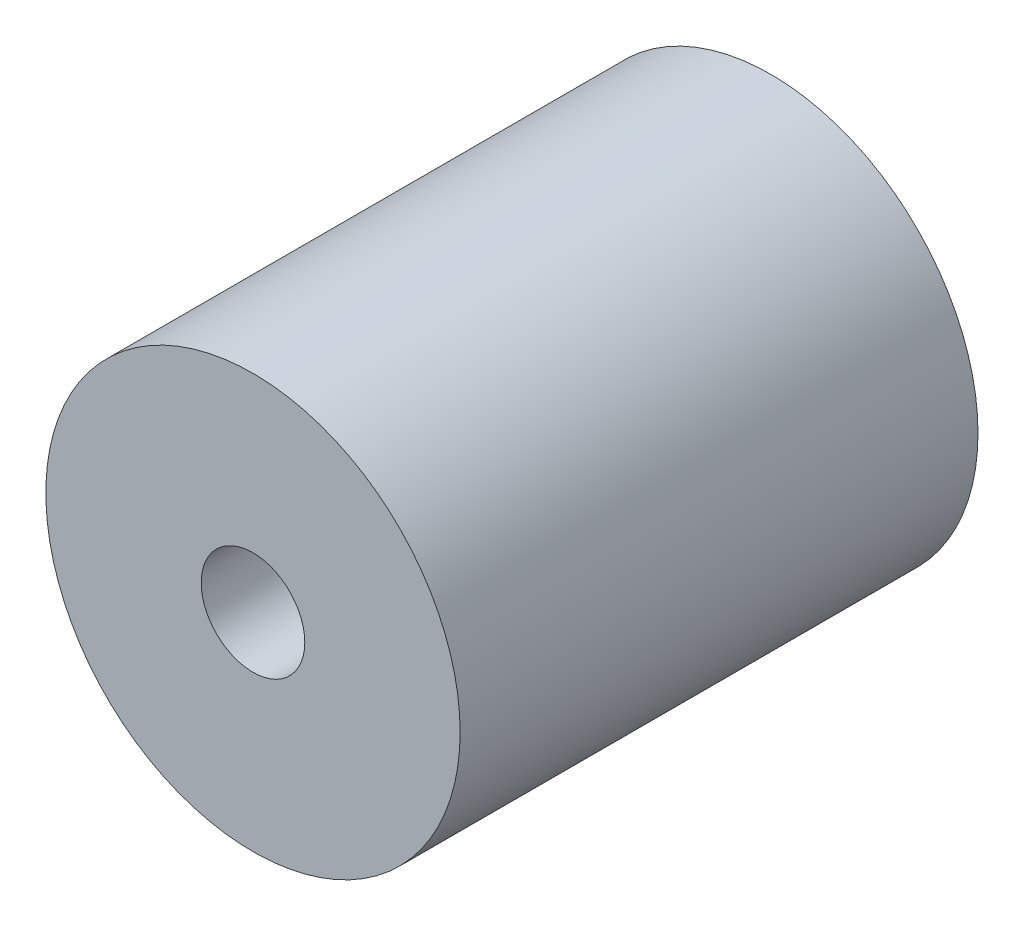
ISO-10303-21;
HEADER;
FILE_DESCRIPTION(('STEP AP214'),'2;1');
FILE_NAME('part.step','',(''),(''),'','','');
FILE_SCHEMA(('AUTOMOTIVE_DESIGN { 1 0 10303 214 1 1 1 1 }'));
ENDSEC;
DATA;
#1=APPLICATION_CONTEXT('core data for automotive mechanical design processes');
#2=APPLICATION_PROTOCOL_DEFINITION('international standard','automotive_design',2000,#1);
#3=PRODUCT_CONTEXT('',#1,'mechanical');
#4=PRODUCT('Part','Part','',(#3));
#5=PRODUCT_RELATED_PRODUCT_CATEGORY('part','',(#4));
#6=PRODUCT_DEFINITION_FORMATION('','',#4);
#7=PRODUCT_DEFINITION_CONTEXT('part definition',#1,'design');
#8=PRODUCT_DEFINITION('design','',#6,#7);
#9=PRODUCT_DEFINITION_SHAPE('','',#8);
#10=(LENGTH_UNIT() NAMED_UNIT(*) SI_UNIT(.MILLI.,.METRE.));
#11=(NAMED_UNIT(*) PLANE_ANGLE_UNIT() SI_UNIT($,.RADIAN.));
#12=(NAMED_UNIT(*) SI_UNIT($,.STERADIAN.) SOLID_ANGLE_UNIT());
#13=UNCERTAINTY_MEASURE_WITH_UNIT(LENGTH_MEASURE(1.E-05),#10,'distance_accuracy_value','');
#14=(GEOMETRIC_REPRESENTATION_CONTEXT(3) GLOBAL_UNCERTAINTY_ASSIGNED_CONTEXT((#13)) GLOBAL_UNIT_ASSIGNED_CONTEXT((#10,
#11,#12)) REPRESENTATION_CONTEXT('',''));
#15=CARTESIAN_POINT('',(0.,0.,0.));
#16=DIRECTION('',(0.,0.,1.));
#17=DIRECTION('',(1.,0.,0.));
#18=AXIS2_PLACEMENT_3D('',#15,#16,#17);
#19=CARTESIAN_POINT('',(0.,0.,25.));
#20=DIRECTION('',(0.,0.,-1.));
#21=DIRECTION('',(-1.,0.,0.));
#22=AXIS2_PLACEMENT_3D('',#19,#20,#21);
#23=CYLINDRICAL_SURFACE('',#22,10.);
#24=CARTESIAN_POINT('',(0.,0.,25.));
#25=DIRECTION('',(0.,0.,1.));
#26=DIRECTION('',(1.,0.,0.));
#27=AXIS2_PLACEMENT_3D('',#24,#25,#26);
#28=CIRCLE('',#27,10.);
#29=CARTESIAN_POINT('',(10.,0.,25.));
#30=VERTEX_POINT('',#29);
#31=EDGE_CURVE('E10',#30,#30,#28,.T.);
#32=ORIENTED_EDGE('',*,*,#31,.F.);
#33=EDGE_LOOP('',(#32));
#34=FACE_BOUND('',#33,.T.);
#35=CARTESIAN_POINT('',(0.,0.,0.));
#36=DIRECTION('',(0.,0.,1.));
#37=DIRECTION('',(1.,0.,0.));
#38=AXIS2_PLACEMENT_3D('',#35,#36,#37);
#39=CIRCLE('',#38,10.);
#40=CARTESIAN_POINT('',(10.,0.,0.));
#41=VERTEX_POINT('',#40);
#42=EDGE_CURVE('E33',#41,#41,#39,.T.);
#43=ORIENTED_EDGE('',*,*,#42,.T.);
#44=EDGE_LOOP('',(#43));
#45=FACE_BOUND('',#44,.T.);
#46=ADVANCED_FACE('F30',(#34,#45),#23,.T.);
#47=CARTESIAN_POINT('',(0.,0.,25.));
#48=DIRECTION('',(0.,0.,1.));
#49=DIRECTION('',(1.,0.,0.));
#50=AXIS2_PLACEMENT_3D('',#47,#48,#49);
#51=PLANE('',#50);
#52=CARTESIAN_POINT('',(0.,0.,25.));
#53=DIRECTION('',(0.,0.,1.));
#54=DIRECTION('',(1.,0.,0.));
#55=AXIS2_PLACEMENT_3D('',#52,#53,#54);
#56=CIRCLE('',#55,2.5);
#57=CARTESIAN_POINT('',(2.5,0.,25.));
#58=VERTEX_POINT('',#57);
#59=EDGE_CURVE('E42',#58,#58,#56,.T.);
#60=ORIENTED_EDGE('',*,*,#59,.F.);
#61=EDGE_LOOP('',(#60));
#62=FACE_BOUND('',#61,.T.);
#63=ORIENTED_EDGE('',*,*,#31,.T.);
#64=EDGE_LOOP('',(#63));
#65=FACE_BOUND('',#64,.T.);
#66=ADVANCED_FACE('F67',(#62,#65),#51,.T.);
#67=CARTESIAN_POINT('',(0.,0.,0.));
#68=DIRECTION('',(0.,0.,1.));
#69=DIRECTION('',(1.,0.,0.));
#70=AXIS2_PLACEMENT_3D('',#67,#68,#69);
#71=PLANE('',#70);
#72=CARTESIAN_POINT('',(0.,0.,0.));
#73=DIRECTION('',(0.,0.,-1.));
#74=DIRECTION('',(-1.,0.,0.));
#75=AXIS2_PLACEMENT_3D('',#72,#73,#74);
#76=CIRCLE('',#75,4.);
#77=CARTESIAN_POINT('',(-4.,0.,0.));
#78=VERTEX_POINT('',#77);
#79=EDGE_CURVE('E48',#78,#78,#76,.T.);
#80=ORIENTED_EDGE('',*,*,#79,.F.);
#81=EDGE_LOOP('',(#80));
#82=FACE_BOUND('',#81,.T.);
#83=ORIENTED_EDGE('',*,*,#42,.F.);
#84=EDGE_LOOP('',(#83));
#85=FACE_BOUND('',#84,.T.);
#86=ADVANCED_FACE('F63',(#82,#85),#71,.F.);
#87=CARTESIAN_POINT('',(0.,0.,15.));
#88=DIRECTION('',(0.,0.,1.));
#89=DIRECTION('',(1.,0.,0.));
#90=AXIS2_PLACEMENT_3D('',#87,#88,#89);
#91=CYLINDRICAL_SURFACE('',#90,2.5);
#92=CARTESIAN_POINT('',(0.,0.,15.));
#93=DIRECTION('',(0.,0.,1.));
#94=DIRECTION('',(1.,0.,0.));
#95=AXIS2_PLACEMENT_3D('',#92,#93,#94);
#96=CIRCLE('',#95,2.5);
#97=CARTESIAN_POINT('',(2.5,0.,15.));
#98=VERTEX_POINT('',#97);
#99=EDGE_CURVE('E40',#98,#98,#96,.T.);
#100=ORIENTED_EDGE('',*,*,#99,.F.);
#101=EDGE_LOOP('',(#100));
#102=FACE_BOUND('',#101,.T.);
#103=ORIENTED_EDGE('',*,*,#59,.T.);
#104=EDGE_LOOP('',(#103));
#105=FACE_BOUND('',#104,.T.);
#106=ADVANCED_FACE('F66',(#102,#105),#91,.F.);
#107=CARTESIAN_POINT('',(0.,0.,15.));
#108=DIRECTION('',(0.,0.,1.));
#109=DIRECTION('',(1.,0.,0.));
#110=AXIS2_PLACEMENT_3D('',#107,#108,#109);
#111=PLANE('',#110);
#112=ORIENTED_EDGE('',*,*,#99,.T.);
#113=EDGE_LOOP('',(#112));
#114=FACE_BOUND('',#113,.T.);
#115=ADVANCED_FACE('F59',(#114),#111,.T.);
#116=CARTESIAN_POINT('',(0.,0.,10.));
#117=DIRECTION('',(0.,0.,-1.));
#118=DIRECTION('',(-1.,0.,0.));
#119=AXIS2_PLACEMENT_3D('',#116,#117,#118);
#120=CYLINDRICAL_SURFACE('',#119,4.);
#121=CARTESIAN_POINT('',(0.,0.,10.));
#122=DIRECTION('',(0.,0.,-1.));
#123=DIRECTION('',(-1.,0.,0.));
#124=AXIS2_PLACEMENT_3D('',#121,#122,#123);
#125=CIRCLE('',#124,4.);
#126=CARTESIAN_POINT('',(-4.,0.,10.));
#127=VERTEX_POINT('',#126);
#128=EDGE_CURVE('E45',#127,#127,#125,.T.);
#129=ORIENTED_EDGE('',*,*,#128,.F.);
#130=EDGE_LOOP('',(#129));
#131=FACE_BOUND('',#130,.T.);
#132=ORIENTED_EDGE('',*,*,#79,.T.);
#133=EDGE_LOOP('',(#132));
#134=FACE_BOUND('',#133,.T.);
#135=ADVANCED_FACE('F56',(#131,#134),#120,.F.);
#136=CARTESIAN_POINT('',(0.,0.,10.));
#137=DIRECTION('',(0.,0.,-1.));
#138=DIRECTION('',(-1.,0.,0.));
#139=AXIS2_PLACEMENT_3D('',#136,#137,#138);
#140=PLANE('',#139);
#141=ORIENTED_EDGE('',*,*,#128,.T.);
#142=EDGE_LOOP('',(#141));
#143=FACE_BOUND('',#142,.T.);
#144=ADVANCED_FACE('F54',(#143),#140,.T.);
#145=CLOSED_SHELL('',(#46,#66,#86,#106,#115,#135,#144));
#146=MANIFOLD_SOLID_BREP('B2',#145);
#147=ADVANCED_BREP_SHAPE_REPRESENTATION('',(#18,#146),#14);
#148=SHAPE_DEFINITION_REPRESENTATION(#9,#147);
ENDSEC;
END-ISO-10303-21;
